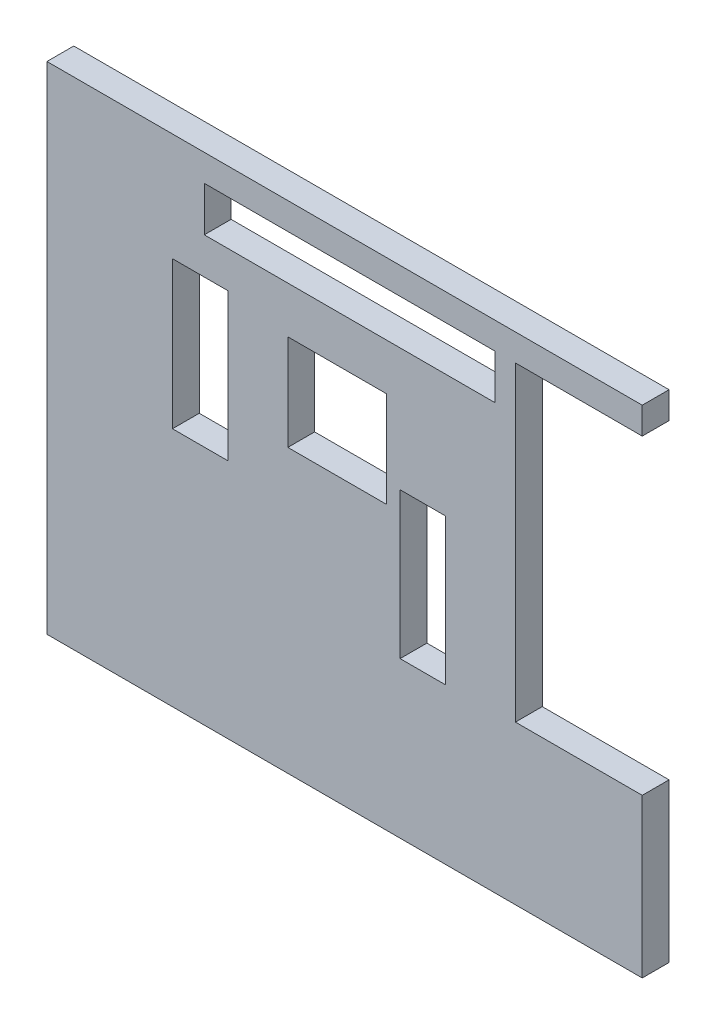
ISO-10303-21;
HEADER;
FILE_DESCRIPTION(('STEP AP214'),'2;1');
FILE_NAME('part.step','',(''),(''),'','','');
FILE_SCHEMA(('AUTOMOTIVE_DESIGN { 1 0 10303 214 1 1 1 1 }'));
ENDSEC;
DATA;
#1=APPLICATION_CONTEXT('core data for automotive mechanical design processes');
#2=APPLICATION_PROTOCOL_DEFINITION('international standard','automotive_design',2000,#1);
#3=PRODUCT_CONTEXT('',#1,'mechanical');
#4=PRODUCT('Part','Part','',(#3));
#5=PRODUCT_RELATED_PRODUCT_CATEGORY('part','',(#4));
#6=PRODUCT_DEFINITION_FORMATION('','',#4);
#7=PRODUCT_DEFINITION_CONTEXT('part definition',#1,'design');
#8=PRODUCT_DEFINITION('design','',#6,#7);
#9=PRODUCT_DEFINITION_SHAPE('','',#8);
#10=(LENGTH_UNIT() NAMED_UNIT(*) SI_UNIT(.MILLI.,.METRE.));
#11=(NAMED_UNIT(*) PLANE_ANGLE_UNIT() SI_UNIT($,.RADIAN.));
#12=(NAMED_UNIT(*) SI_UNIT($,.STERADIAN.) SOLID_ANGLE_UNIT());
#13=UNCERTAINTY_MEASURE_WITH_UNIT(LENGTH_MEASURE(1.E-05),#10,'distance_accuracy_value','');
#14=(GEOMETRIC_REPRESENTATION_CONTEXT(3) GLOBAL_UNCERTAINTY_ASSIGNED_CONTEXT((#13)) GLOBAL_UNIT_ASSIGNED_CONTEXT((#10,
#11,#12)) REPRESENTATION_CONTEXT('',''));
#15=CARTESIAN_POINT('',(0.,0.,0.));
#16=DIRECTION('',(0.,0.,1.));
#17=DIRECTION('',(1.,0.,0.));
#18=AXIS2_PLACEMENT_3D('',#15,#16,#17);
#19=CARTESIAN_POINT('',(0.,0.,5.));
#20=DIRECTION('',(0.,0.,1.));
#21=DIRECTION('',(1.,0.,0.));
#22=AXIS2_PLACEMENT_3D('',#19,#20,#21);
#23=PLANE('',#22);
#24=DIRECTION('',(-1.,0.,0.));
#25=VECTOR('',#24,1.);
#26=CARTESIAN_POINT('',(111.553582562333,91.831917191368,5.));
#27=LINE('',#26,#25);
#28=CARTESIAN_POINT('',(111.553582562333,91.831917191368,5.));
#29=VERTEX_POINT('',#28);
#30=CARTESIAN_POINT('',(0.553582562333453,91.831917191368,5.));
#31=VERTEX_POINT('',#30);
#32=EDGE_CURVE('E405',#29,#31,#27,.T.);
#33=ORIENTED_EDGE('',*,*,#32,.T.);
#34=DIRECTION('',(0.,-1.,0.));
#35=VECTOR('',#34,1.);
#36=CARTESIAN_POINT('',(0.553582562333453,91.831917191368,5.));
#37=LINE('',#36,#35);
#38=CARTESIAN_POINT('',(0.553582562333453,-0.668082808632039,5.));
#39=VERTEX_POINT('',#38);
#40=EDGE_CURVE('E409',#31,#39,#37,.T.);
#41=ORIENTED_EDGE('',*,*,#40,.T.);
#42=DIRECTION('',(-1.,0.,0.));
#43=VECTOR('',#42,1.);
#44=CARTESIAN_POINT('',(111.553582562334,-0.668082808632039,5.));
#45=LINE('',#44,#43);
#46=CARTESIAN_POINT('',(111.553582562334,-0.668082808632039,5.));
#47=VERTEX_POINT('',#46);
#48=EDGE_CURVE('E231',#47,#39,#45,.T.);
#49=ORIENTED_EDGE('',*,*,#48,.F.);
#50=DIRECTION('',(0.,1.,0.));
#51=VECTOR('',#50,1.);
#52=CARTESIAN_POINT('',(111.553582562334,5.33191719136796,5.));
#53=LINE('',#52,#51);
#54=CARTESIAN_POINT('',(111.553582562334,28.831917191368,5.));
#55=VERTEX_POINT('',#54);
#56=EDGE_CURVE('E413',#47,#55,#53,.T.);
#57=ORIENTED_EDGE('',*,*,#56,.T.);
#58=DIRECTION('',(-1.,0.,0.));
#59=VECTOR('',#58,1.);
#60=CARTESIAN_POINT('',(87.9094563292489,28.831917191368,5.));
#61=LINE('',#60,#59);
#62=CARTESIAN_POINT('',(87.9094563292489,28.831917191368,5.));
#63=VERTEX_POINT('',#62);
#64=EDGE_CURVE('E416',#55,#63,#61,.T.);
#65=ORIENTED_EDGE('',*,*,#64,.T.);
#66=DIRECTION('',(0.,1.,0.));
#67=VECTOR('',#66,1.);
#68=CARTESIAN_POINT('',(87.9094563292489,86.831917191368,5.));
#69=LINE('',#68,#67);
#70=CARTESIAN_POINT('',(87.9094563292489,86.831917191368,5.));
#71=VERTEX_POINT('',#70);
#72=EDGE_CURVE('E419',#63,#71,#69,.T.);
#73=ORIENTED_EDGE('',*,*,#72,.T.);
#74=DIRECTION('',(1.,0.,0.));
#75=VECTOR('',#74,1.);
#76=CARTESIAN_POINT('',(87.9094563292489,86.831917191368,5.));
#77=LINE('',#76,#75);
#78=CARTESIAN_POINT('',(111.553582562334,86.831917191368,5.));
#79=VERTEX_POINT('',#78);
#80=EDGE_CURVE('E422',#71,#79,#77,.T.);
#81=ORIENTED_EDGE('',*,*,#80,.T.);
#82=DIRECTION('',(0.,1.,0.));
#83=VECTOR('',#82,1.);
#84=CARTESIAN_POINT('',(111.553582562334,86.831917191368,5.));
#85=LINE('',#84,#83);
#86=EDGE_CURVE('E425',#79,#29,#85,.T.);
#87=ORIENTED_EDGE('',*,*,#86,.T.);
#88=EDGE_LOOP('',(#33,#41,#49,#57,#65,#73,#81,#87));
#89=FACE_BOUND('',#88,.T.);
#90=DIRECTION('',(1.,0.,0.));
#91=VECTOR('',#90,1.);
#92=CARTESIAN_POINT('',(29.8895659596349,78.5077999769822,5.));
#93=LINE('',#92,#91);
#94=CARTESIAN_POINT('',(29.8895659596349,78.5077999769822,5.));
#95=VERTEX_POINT('',#94);
#96=CARTESIAN_POINT('',(84.0931199139453,78.5077999769822,5.));
#97=VERTEX_POINT('',#96);
#98=EDGE_CURVE('E366',#95,#97,#93,.T.);
#99=ORIENTED_EDGE('',*,*,#98,.F.);
#100=DIRECTION('',(0.,-1.,0.));
#101=VECTOR('',#100,1.);
#102=CARTESIAN_POINT('',(29.8895659596349,86.831917191368,5.));
#103=LINE('',#102,#101);
#104=CARTESIAN_POINT('',(29.8895659596349,86.831917191368,5.));
#105=VERTEX_POINT('',#104);
#106=EDGE_CURVE('E363',#105,#95,#103,.T.);
#107=ORIENTED_EDGE('',*,*,#106,.F.);
#108=DIRECTION('',(-1.,0.,0.));
#109=VECTOR('',#108,1.);
#110=CARTESIAN_POINT('',(29.8895659596349,86.831917191368,5.));
#111=LINE('',#110,#109);
#112=CARTESIAN_POINT('',(84.0931199139453,86.831917191368,5.));
#113=VERTEX_POINT('',#112);
#114=EDGE_CURVE('E374',#113,#105,#111,.T.);
#115=ORIENTED_EDGE('',*,*,#114,.F.);
#116=DIRECTION('',(0.,1.,0.));
#117=VECTOR('',#116,1.);
#118=CARTESIAN_POINT('',(84.0931199139453,86.831917191368,5.));
#119=LINE('',#118,#117);
#120=EDGE_CURVE('E370',#97,#113,#119,.T.);
#121=ORIENTED_EDGE('',*,*,#120,.F.);
#122=EDGE_LOOP('',(#99,#107,#115,#121));
#123=FACE_BOUND('',#122,.T.);
#124=DIRECTION('',(1.,0.,0.));
#125=VECTOR('',#124,1.);
#126=CARTESIAN_POINT('',(23.9606206307256,44.2276050995337,5.));
#127=LINE('',#126,#125);
#128=CARTESIAN_POINT('',(23.9606206307256,44.2276050995337,5.));
#129=VERTEX_POINT('',#128);
#130=CARTESIAN_POINT('',(34.3307020953509,44.2276050995337,5.));
#131=VERTEX_POINT('',#130);
#132=EDGE_CURVE('E323',#129,#131,#127,.T.);
#133=ORIENTED_EDGE('',*,*,#132,.F.);
#134=DIRECTION('',(0.,-1.,0.));
#135=VECTOR('',#134,1.);
#136=CARTESIAN_POINT('',(23.9606206307256,71.6891171262523,5.));
#137=LINE('',#136,#135);
#138=CARTESIAN_POINT('',(23.9606206307256,71.6891171262523,5.));
#139=VERTEX_POINT('',#138);
#140=EDGE_CURVE('E320',#139,#129,#137,.T.);
#141=ORIENTED_EDGE('',*,*,#140,.F.);
#142=DIRECTION('',(-1.,0.,0.));
#143=VECTOR('',#142,1.);
#144=CARTESIAN_POINT('',(23.9606206307256,71.6891171262523,5.));
#145=LINE('',#144,#143);
#146=CARTESIAN_POINT('',(34.3307020953509,71.6891171262523,5.));
#147=VERTEX_POINT('',#146);
#148=EDGE_CURVE('E331',#147,#139,#145,.T.);
#149=ORIENTED_EDGE('',*,*,#148,.F.);
#150=DIRECTION('',(0.,1.,0.));
#151=VECTOR('',#150,1.);
#152=CARTESIAN_POINT('',(34.3307020953509,71.6891171262523,5.));
#153=LINE('',#152,#151);
#154=EDGE_CURVE('E327',#131,#147,#153,.T.);
#155=ORIENTED_EDGE('',*,*,#154,.F.);
#156=EDGE_LOOP('',(#133,#141,#149,#155));
#157=FACE_BOUND('',#156,.T.);
#158=DIRECTION('',(1.,0.,0.));
#159=VECTOR('',#158,1.);
#160=CARTESIAN_POINT('',(66.4011392174332,28.331917191368,5.));
#161=LINE('',#160,#159);
#162=CARTESIAN_POINT('',(66.4011392174332,28.331917191368,5.));
#163=VERTEX_POINT('',#162);
#164=CARTESIAN_POINT('',(74.8508352256465,28.331917191368,5.));
#165=VERTEX_POINT('',#164);
#166=EDGE_CURVE('E280',#163,#165,#161,.T.);
#167=ORIENTED_EDGE('',*,*,#166,.F.);
#168=DIRECTION('',(0.,-1.,0.));
#169=VECTOR('',#168,1.);
#170=CARTESIAN_POINT('',(66.4011392174332,55.6013906724237,5.));
#171=LINE('',#170,#169);
#172=CARTESIAN_POINT('',(66.4011392174332,55.6013906724237,5.));
#173=VERTEX_POINT('',#172);
#174=EDGE_CURVE('E277',#173,#163,#171,.T.);
#175=ORIENTED_EDGE('',*,*,#174,.F.);
#176=DIRECTION('',(-1.,0.,0.));
#177=VECTOR('',#176,1.);
#178=CARTESIAN_POINT('',(66.4011392174332,55.6013906724237,5.));
#179=LINE('',#178,#177);
#180=CARTESIAN_POINT('',(74.8508352256465,55.6013906724237,5.));
#181=VERTEX_POINT('',#180);
#182=EDGE_CURVE('E288',#181,#173,#179,.T.);
#183=ORIENTED_EDGE('',*,*,#182,.F.);
#184=DIRECTION('',(0.,1.,0.));
#185=VECTOR('',#184,1.);
#186=CARTESIAN_POINT('',(74.8508352256465,55.6013906724237,5.));
#187=LINE('',#186,#185);
#188=EDGE_CURVE('E284',#165,#181,#187,.T.);
#189=ORIENTED_EDGE('',*,*,#188,.F.);
#190=EDGE_LOOP('',(#167,#175,#183,#189));
#191=FACE_BOUND('',#190,.T.);
#192=DIRECTION('',(1.,0.,0.));
#193=VECTOR('',#192,1.);
#194=CARTESIAN_POINT('',(45.4689377425412,51.9723324467121,5.));
#195=LINE('',#194,#193);
#196=CARTESIAN_POINT('',(45.4689377425412,51.9723324467121,5.));
#197=VERTEX_POINT('',#196);
#198=CARTESIAN_POINT('',(63.9046381240975,51.9723324467121,5.));
#199=VERTEX_POINT('',#198);
#200=EDGE_CURVE('E242',#197,#199,#195,.T.);
#201=ORIENTED_EDGE('',*,*,#200,.F.);
#202=DIRECTION('',(0.,-1.,0.));
#203=VECTOR('',#202,1.);
#204=CARTESIAN_POINT('',(45.4689377425412,69.831917191368,5.));
#205=LINE('',#204,#203);
#206=CARTESIAN_POINT('',(45.4689377425412,69.831917191368,5.));
#207=VERTEX_POINT('',#206);
#208=EDGE_CURVE('E239',#207,#197,#205,.T.);
#209=ORIENTED_EDGE('',*,*,#208,.F.);
#210=DIRECTION('',(-1.,0.,0.));
#211=VECTOR('',#210,1.);
#212=CARTESIAN_POINT('',(45.4689377425412,69.831917191368,5.));
#213=LINE('',#212,#211);
#214=CARTESIAN_POINT('',(63.9046381240975,69.831917191368,5.));
#215=VERTEX_POINT('',#214);
#216=EDGE_CURVE('E249',#215,#207,#213,.T.);
#217=ORIENTED_EDGE('',*,*,#216,.F.);
#218=DIRECTION('',(0.,1.,0.));
#219=VECTOR('',#218,1.);
#220=CARTESIAN_POINT('',(63.9046381240975,69.831917191368,5.));
#221=LINE('',#220,#219);
#222=EDGE_CURVE('E246',#199,#215,#221,.T.);
#223=ORIENTED_EDGE('',*,*,#222,.F.);
#224=EDGE_LOOP('',(#201,#209,#217,#223));
#225=FACE_BOUND('',#224,.T.);
#226=ADVANCED_FACE('F41',(#89,#123,#157,#191,#225),#23,.T.);
#227=CARTESIAN_POINT('',(0.,0.,0.));
#228=DIRECTION('',(0.,0.,1.));
#229=DIRECTION('',(1.,0.,0.));
#230=AXIS2_PLACEMENT_3D('',#227,#228,#229);
#231=PLANE('',#230);
#232=DIRECTION('',(0.,-1.,0.));
#233=VECTOR('',#232,1.);
#234=CARTESIAN_POINT('',(66.4011392174332,55.6013906724237,0.));
#235=LINE('',#234,#233);
#236=CARTESIAN_POINT('',(66.4011392174332,55.6013906724237,0.));
#237=VERTEX_POINT('',#236);
#238=CARTESIAN_POINT('',(66.4011392174332,28.331917191368,0.));
#239=VERTEX_POINT('',#238);
#240=EDGE_CURVE('E276',#237,#239,#235,.T.);
#241=ORIENTED_EDGE('',*,*,#240,.T.);
#242=DIRECTION('',(1.,0.,0.));
#243=VECTOR('',#242,1.);
#244=CARTESIAN_POINT('',(66.4011392174332,28.331917191368,0.));
#245=LINE('',#244,#243);
#246=CARTESIAN_POINT('',(74.8508352256465,28.331917191368,0.));
#247=VERTEX_POINT('',#246);
#248=EDGE_CURVE('E295',#239,#247,#245,.T.);
#249=ORIENTED_EDGE('',*,*,#248,.T.);
#250=DIRECTION('',(0.,1.,0.));
#251=VECTOR('',#250,1.);
#252=CARTESIAN_POINT('',(74.8508352256465,55.6013906724237,0.));
#253=LINE('',#252,#251);
#254=CARTESIAN_POINT('',(74.8508352256465,55.6013906724237,0.));
#255=VERTEX_POINT('',#254);
#256=EDGE_CURVE('E299',#247,#255,#253,.T.);
#257=ORIENTED_EDGE('',*,*,#256,.T.);
#258=DIRECTION('',(-1.,0.,0.));
#259=VECTOR('',#258,1.);
#260=CARTESIAN_POINT('',(66.4011392174332,55.6013906724237,0.));
#261=LINE('',#260,#259);
#262=EDGE_CURVE('E281',#255,#237,#261,.T.);
#263=ORIENTED_EDGE('',*,*,#262,.T.);
#264=EDGE_LOOP('',(#241,#249,#257,#263));
#265=FACE_BOUND('',#264,.T.);
#266=DIRECTION('',(0.,-1.,0.));
#267=VECTOR('',#266,1.);
#268=CARTESIAN_POINT('',(29.8895659596349,86.831917191368,0.));
#269=LINE('',#268,#267);
#270=CARTESIAN_POINT('',(29.8895659596349,86.831917191368,0.));
#271=VERTEX_POINT('',#270);
#272=CARTESIAN_POINT('',(29.8895659596349,78.5077999769822,0.));
#273=VERTEX_POINT('',#272);
#274=EDGE_CURVE('E362',#271,#273,#269,.T.);
#275=ORIENTED_EDGE('',*,*,#274,.T.);
#276=DIRECTION('',(1.,0.,0.));
#277=VECTOR('',#276,1.);
#278=CARTESIAN_POINT('',(29.8895659596349,78.5077999769822,0.));
#279=LINE('',#278,#277);
#280=CARTESIAN_POINT('',(84.0931199139453,78.5077999769822,0.));
#281=VERTEX_POINT('',#280);
#282=EDGE_CURVE('E381',#273,#281,#279,.T.);
#283=ORIENTED_EDGE('',*,*,#282,.T.);
#284=DIRECTION('',(0.,1.,0.));
#285=VECTOR('',#284,1.);
#286=CARTESIAN_POINT('',(84.0931199139453,86.831917191368,0.));
#287=LINE('',#286,#285);
#288=CARTESIAN_POINT('',(84.0931199139453,86.831917191368,0.));
#289=VERTEX_POINT('',#288);
#290=EDGE_CURVE('E385',#281,#289,#287,.T.);
#291=ORIENTED_EDGE('',*,*,#290,.T.);
#292=DIRECTION('',(-1.,0.,0.));
#293=VECTOR('',#292,1.);
#294=CARTESIAN_POINT('',(29.8895659596349,86.831917191368,0.));
#295=LINE('',#294,#293);
#296=EDGE_CURVE('E367',#289,#271,#295,.T.);
#297=ORIENTED_EDGE('',*,*,#296,.T.);
#298=EDGE_LOOP('',(#275,#283,#291,#297));
#299=FACE_BOUND('',#298,.T.);
#300=DIRECTION('',(-1.,0.,0.));
#301=VECTOR('',#300,1.);
#302=CARTESIAN_POINT('',(111.553582562333,91.831917191368,0.));
#303=LINE('',#302,#301);
#304=CARTESIAN_POINT('',(111.553582562333,91.831917191368,0.));
#305=VERTEX_POINT('',#304);
#306=CARTESIAN_POINT('',(0.553582562333453,91.831917191368,0.));
#307=VERTEX_POINT('',#306);
#308=EDGE_CURVE('E215',#305,#307,#303,.T.);
#309=ORIENTED_EDGE('',*,*,#308,.F.);
#310=DIRECTION('',(0.,1.,0.));
#311=VECTOR('',#310,1.);
#312=CARTESIAN_POINT('',(111.553582562334,86.831917191368,0.));
#313=LINE('',#312,#311);
#314=CARTESIAN_POINT('',(111.553582562334,86.831917191368,0.));
#315=VERTEX_POINT('',#314);
#316=EDGE_CURVE('E410',#315,#305,#313,.T.);
#317=ORIENTED_EDGE('',*,*,#316,.F.);
#318=DIRECTION('',(1.,0.,0.));
#319=VECTOR('',#318,1.);
#320=CARTESIAN_POINT('',(87.9094563292489,86.831917191368,0.));
#321=LINE('',#320,#319);
#322=CARTESIAN_POINT('',(87.9094563292489,86.831917191368,0.));
#323=VERTEX_POINT('',#322);
#324=EDGE_CURVE('E439',#323,#315,#321,.T.);
#325=ORIENTED_EDGE('',*,*,#324,.F.);
#326=DIRECTION('',(0.,1.,0.));
#327=VECTOR('',#326,1.);
#328=CARTESIAN_POINT('',(87.9094563292489,86.831917191368,0.));
#329=LINE('',#328,#327);
#330=CARTESIAN_POINT('',(87.9094563292489,28.831917191368,0.));
#331=VERTEX_POINT('',#330);
#332=EDGE_CURVE('E436',#331,#323,#329,.T.);
#333=ORIENTED_EDGE('',*,*,#332,.F.);
#334=DIRECTION('',(-1.,0.,0.));
#335=VECTOR('',#334,1.);
#336=CARTESIAN_POINT('',(87.9094563292489,28.831917191368,0.));
#337=LINE('',#336,#335);
#338=CARTESIAN_POINT('',(111.553582562334,28.831917191368,0.));
#339=VERTEX_POINT('',#338);
#340=EDGE_CURVE('E433',#339,#331,#337,.T.);
#341=ORIENTED_EDGE('',*,*,#340,.F.);
#342=DIRECTION('',(0.,1.,0.));
#343=VECTOR('',#342,1.);
#344=CARTESIAN_POINT('',(111.553582562334,5.33191719136796,0.));
#345=LINE('',#344,#343);
#346=CARTESIAN_POINT('',(111.553582562334,-0.668082808632039,0.));
#347=VERTEX_POINT('',#346);
#348=EDGE_CURVE('E214',#347,#339,#345,.T.);
#349=ORIENTED_EDGE('',*,*,#348,.F.);
#350=DIRECTION('',(1.,0.,0.));
#351=VECTOR('',#350,1.);
#352=CARTESIAN_POINT('',(0.553582562333453,-0.668082808632039,0.));
#353=LINE('',#352,#351);
#354=CARTESIAN_POINT('',(0.553582562333453,-0.668082808632039,0.));
#355=VERTEX_POINT('',#354);
#356=EDGE_CURVE('E218',#355,#347,#353,.T.);
#357=ORIENTED_EDGE('',*,*,#356,.F.);
#358=DIRECTION('',(0.,-1.,0.));
#359=VECTOR('',#358,1.);
#360=CARTESIAN_POINT('',(0.553582562333453,91.831917191368,0.));
#361=LINE('',#360,#359);
#362=EDGE_CURVE('E204',#307,#355,#361,.T.);
#363=ORIENTED_EDGE('',*,*,#362,.F.);
#364=EDGE_LOOP('',(#309,#317,#325,#333,#341,#349,#357,#363));
#365=FACE_BOUND('',#364,.T.);
#366=DIRECTION('',(0.,-1.,0.));
#367=VECTOR('',#366,1.);
#368=CARTESIAN_POINT('',(23.9606206307256,71.6891171262523,0.));
#369=LINE('',#368,#367);
#370=CARTESIAN_POINT('',(23.9606206307256,71.6891171262523,0.));
#371=VERTEX_POINT('',#370);
#372=CARTESIAN_POINT('',(23.9606206307256,44.2276050995337,0.));
#373=VERTEX_POINT('',#372);
#374=EDGE_CURVE('E319',#371,#373,#369,.T.);
#375=ORIENTED_EDGE('',*,*,#374,.T.);
#376=DIRECTION('',(1.,0.,0.));
#377=VECTOR('',#376,1.);
#378=CARTESIAN_POINT('',(23.9606206307256,44.2276050995337,0.));
#379=LINE('',#378,#377);
#380=CARTESIAN_POINT('',(34.3307020953509,44.2276050995337,0.));
#381=VERTEX_POINT('',#380);
#382=EDGE_CURVE('E338',#373,#381,#379,.T.);
#383=ORIENTED_EDGE('',*,*,#382,.T.);
#384=DIRECTION('',(0.,1.,0.));
#385=VECTOR('',#384,1.);
#386=CARTESIAN_POINT('',(34.3307020953509,71.6891171262523,0.));
#387=LINE('',#386,#385);
#388=CARTESIAN_POINT('',(34.3307020953509,71.6891171262523,0.));
#389=VERTEX_POINT('',#388);
#390=EDGE_CURVE('E342',#381,#389,#387,.T.);
#391=ORIENTED_EDGE('',*,*,#390,.T.);
#392=DIRECTION('',(-1.,0.,0.));
#393=VECTOR('',#392,1.);
#394=CARTESIAN_POINT('',(23.9606206307256,71.6891171262523,0.));
#395=LINE('',#394,#393);
#396=EDGE_CURVE('E324',#389,#371,#395,.T.);
#397=ORIENTED_EDGE('',*,*,#396,.T.);
#398=EDGE_LOOP('',(#375,#383,#391,#397));
#399=FACE_BOUND('',#398,.T.);
#400=DIRECTION('',(0.,-1.,0.));
#401=VECTOR('',#400,1.);
#402=CARTESIAN_POINT('',(45.4689377425412,69.831917191368,0.));
#403=LINE('',#402,#401);
#404=CARTESIAN_POINT('',(45.4689377425412,69.831917191368,0.));
#405=VERTEX_POINT('',#404);
#406=CARTESIAN_POINT('',(45.4689377425412,51.9723324467121,0.));
#407=VERTEX_POINT('',#406);
#408=EDGE_CURVE('E65',#405,#407,#403,.T.);
#409=ORIENTED_EDGE('',*,*,#408,.T.);
#410=DIRECTION('',(1.,0.,0.));
#411=VECTOR('',#410,1.);
#412=CARTESIAN_POINT('',(45.4689377425412,51.9723324467121,0.));
#413=LINE('',#412,#411);
#414=CARTESIAN_POINT('',(63.9046381240975,51.9723324467121,0.));
#415=VERTEX_POINT('',#414);
#416=EDGE_CURVE('E255',#407,#415,#413,.T.);
#417=ORIENTED_EDGE('',*,*,#416,.T.);
#418=DIRECTION('',(0.,1.,0.));
#419=VECTOR('',#418,1.);
#420=CARTESIAN_POINT('',(63.9046381240975,69.831917191368,0.));
#421=LINE('',#420,#419);
#422=CARTESIAN_POINT('',(63.9046381240975,69.831917191368,0.));
#423=VERTEX_POINT('',#422);
#424=EDGE_CURVE('E259',#415,#423,#421,.T.);
#425=ORIENTED_EDGE('',*,*,#424,.T.);
#426=DIRECTION('',(-1.,0.,0.));
#427=VECTOR('',#426,1.);
#428=CARTESIAN_POINT('',(45.4689377425412,69.831917191368,0.));
#429=LINE('',#428,#427);
#430=EDGE_CURVE('E243',#423,#405,#429,.T.);
#431=ORIENTED_EDGE('',*,*,#430,.T.);
#432=EDGE_LOOP('',(#409,#417,#425,#431));
#433=FACE_BOUND('',#432,.T.);
#434=ADVANCED_FACE('F219',(#265,#299,#365,#399,#433),#231,.F.);
#435=CARTESIAN_POINT('',(111.553582562333,91.831917191368,5.));
#436=DIRECTION('',(0.,-1.,0.));
#437=DIRECTION('',(1.,0.,0.));
#438=AXIS2_PLACEMENT_3D('',#435,#436,#437);
#439=PLANE('',#438);
#440=ORIENTED_EDGE('',*,*,#308,.T.);
#441=DIRECTION('',(0.,0.,-1.));
#442=VECTOR('',#441,1.);
#443=CARTESIAN_POINT('',(0.553582562333453,91.831917191368,5.));
#444=LINE('',#443,#442);
#445=EDGE_CURVE('E11',#31,#307,#444,.T.);
#446=ORIENTED_EDGE('',*,*,#445,.F.);
#447=ORIENTED_EDGE('',*,*,#32,.F.);
#448=DIRECTION('',(0.,0.,-1.));
#449=VECTOR('',#448,1.);
#450=CARTESIAN_POINT('',(111.553582562333,91.831917191368,5.));
#451=LINE('',#450,#449);
#452=EDGE_CURVE('E428',#29,#305,#451,.T.);
#453=ORIENTED_EDGE('',*,*,#452,.T.);
#454=EDGE_LOOP('',(#440,#446,#447,#453));
#455=FACE_BOUND('',#454,.T.);
#456=ADVANCED_FACE('F43',(#455),#439,.F.);
#457=CARTESIAN_POINT('',(0.553582562333453,91.831917191368,5.));
#458=DIRECTION('',(1.,0.,0.));
#459=DIRECTION('',(0.,0.,-1.));
#460=AXIS2_PLACEMENT_3D('',#457,#458,#459);
#461=PLANE('',#460);
#462=ORIENTED_EDGE('',*,*,#362,.T.);
#463=DIRECTION('',(0.,0.,-1.));
#464=VECTOR('',#463,1.);
#465=CARTESIAN_POINT('',(0.553582562333453,-0.668082808632039,5.));
#466=LINE('',#465,#464);
#467=EDGE_CURVE('E208',#39,#355,#466,.T.);
#468=ORIENTED_EDGE('',*,*,#467,.F.);
#469=ORIENTED_EDGE('',*,*,#40,.F.);
#470=ORIENTED_EDGE('',*,*,#445,.T.);
#471=EDGE_LOOP('',(#462,#468,#469,#470));
#472=FACE_BOUND('',#471,.T.);
#473=ADVANCED_FACE('F206',(#472),#461,.F.);
#474=CARTESIAN_POINT('',(111.553582562334,5.33191719136796,5.));
#475=DIRECTION('',(-1.,0.,0.));
#476=DIRECTION('',(0.,0.,1.));
#477=AXIS2_PLACEMENT_3D('',#474,#475,#476);
#478=PLANE('',#477);
#479=ORIENTED_EDGE('',*,*,#348,.T.);
#480=DIRECTION('',(0.,0.,-1.));
#481=VECTOR('',#480,1.);
#482=CARTESIAN_POINT('',(111.553582562334,28.831917191368,5.));
#483=LINE('',#482,#481);
#484=EDGE_CURVE('E50',#55,#339,#483,.T.);
#485=ORIENTED_EDGE('',*,*,#484,.F.);
#486=ORIENTED_EDGE('',*,*,#56,.F.);
#487=DIRECTION('',(0.,0.,1.));
#488=VECTOR('',#487,1.);
#489=CARTESIAN_POINT('',(111.553582562334,-0.668082808632039,0.));
#490=LINE('',#489,#488);
#491=EDGE_CURVE('E226',#347,#47,#490,.T.);
#492=ORIENTED_EDGE('',*,*,#491,.F.);
#493=EDGE_LOOP('',(#479,#485,#486,#492));
#494=FACE_BOUND('',#493,.T.);
#495=ADVANCED_FACE('F481',(#494),#478,.F.);
#496=CARTESIAN_POINT('',(87.9094563292489,28.831917191368,5.));
#497=DIRECTION('',(0.,-1.,0.));
#498=DIRECTION('',(1.,0.,0.));
#499=AXIS2_PLACEMENT_3D('',#496,#497,#498);
#500=PLANE('',#499);
#501=ORIENTED_EDGE('',*,*,#340,.T.);
#502=DIRECTION('',(0.,0.,-1.));
#503=VECTOR('',#502,1.);
#504=CARTESIAN_POINT('',(87.9094563292489,28.831917191368,5.));
#505=LINE('',#504,#503);
#506=EDGE_CURVE('E455',#63,#331,#505,.T.);
#507=ORIENTED_EDGE('',*,*,#506,.F.);
#508=ORIENTED_EDGE('',*,*,#64,.F.);
#509=ORIENTED_EDGE('',*,*,#484,.T.);
#510=EDGE_LOOP('',(#501,#507,#508,#509));
#511=FACE_BOUND('',#510,.T.);
#512=ADVANCED_FACE('F463',(#511),#500,.F.);
#513=CARTESIAN_POINT('',(87.9094563292489,86.831917191368,5.));
#514=DIRECTION('',(-1.,0.,0.));
#515=DIRECTION('',(0.,0.,1.));
#516=AXIS2_PLACEMENT_3D('',#513,#514,#515);
#517=PLANE('',#516);
#518=ORIENTED_EDGE('',*,*,#332,.T.);
#519=DIRECTION('',(0.,0.,-1.));
#520=VECTOR('',#519,1.);
#521=CARTESIAN_POINT('',(87.9094563292489,86.831917191368,5.));
#522=LINE('',#521,#520);
#523=EDGE_CURVE('E451',#71,#323,#522,.T.);
#524=ORIENTED_EDGE('',*,*,#523,.F.);
#525=ORIENTED_EDGE('',*,*,#72,.F.);
#526=ORIENTED_EDGE('',*,*,#506,.T.);
#527=EDGE_LOOP('',(#518,#524,#525,#526));
#528=FACE_BOUND('',#527,.T.);
#529=ADVANCED_FACE('F471',(#528),#517,.F.);
#530=CARTESIAN_POINT('',(87.9094563292489,86.831917191368,5.));
#531=DIRECTION('',(0.,1.,0.));
#532=DIRECTION('',(0.,0.,1.));
#533=AXIS2_PLACEMENT_3D('',#530,#531,#532);
#534=PLANE('',#533);
#535=ORIENTED_EDGE('',*,*,#324,.T.);
#536=DIRECTION('',(0.,0.,-1.));
#537=VECTOR('',#536,1.);
#538=CARTESIAN_POINT('',(111.553582562334,86.831917191368,5.));
#539=LINE('',#538,#537);
#540=EDGE_CURVE('E447',#79,#315,#539,.T.);
#541=ORIENTED_EDGE('',*,*,#540,.F.);
#542=ORIENTED_EDGE('',*,*,#80,.F.);
#543=ORIENTED_EDGE('',*,*,#523,.T.);
#544=EDGE_LOOP('',(#535,#541,#542,#543));
#545=FACE_BOUND('',#544,.T.);
#546=ADVANCED_FACE('F475',(#545),#534,.F.);
#547=CARTESIAN_POINT('',(111.553582562334,86.831917191368,5.));
#548=DIRECTION('',(-1.,0.,0.));
#549=DIRECTION('',(0.,-1.,0.));
#550=AXIS2_PLACEMENT_3D('',#547,#548,#549);
#551=PLANE('',#550);
#552=ORIENTED_EDGE('',*,*,#316,.T.);
#553=ORIENTED_EDGE('',*,*,#452,.F.);
#554=ORIENTED_EDGE('',*,*,#86,.F.);
#555=ORIENTED_EDGE('',*,*,#540,.T.);
#556=EDGE_LOOP('',(#552,#553,#554,#555));
#557=FACE_BOUND('',#556,.T.);
#558=ADVANCED_FACE('F502',(#557),#551,.F.);
#559=CARTESIAN_POINT('',(29.8895659596349,86.831917191368,5.));
#560=DIRECTION('',(1.,0.,0.));
#561=DIRECTION('',(0.,0.,-1.));
#562=AXIS2_PLACEMENT_3D('',#559,#560,#561);
#563=PLANE('',#562);
#564=ORIENTED_EDGE('',*,*,#274,.F.);
#565=DIRECTION('',(0.,0.,-1.));
#566=VECTOR('',#565,1.);
#567=CARTESIAN_POINT('',(29.8895659596349,86.831917191368,5.));
#568=LINE('',#567,#566);
#569=EDGE_CURVE('E377',#105,#271,#568,.T.);
#570=ORIENTED_EDGE('',*,*,#569,.F.);
#571=ORIENTED_EDGE('',*,*,#106,.T.);
#572=DIRECTION('',(0.,0.,-1.));
#573=VECTOR('',#572,1.);
#574=CARTESIAN_POINT('',(29.8895659596349,78.5077999769822,5.));
#575=LINE('',#574,#573);
#576=EDGE_CURVE('E401',#95,#273,#575,.T.);
#577=ORIENTED_EDGE('',*,*,#576,.T.);
#578=EDGE_LOOP('',(#564,#570,#571,#577));
#579=FACE_BOUND('',#578,.T.);
#580=ADVANCED_FACE('F499',(#579),#563,.T.);
#581=CARTESIAN_POINT('',(29.8895659596349,78.5077999769822,5.));
#582=DIRECTION('',(0.,1.,0.));
#583=DIRECTION('',(-1.,0.,0.));
#584=AXIS2_PLACEMENT_3D('',#581,#582,#583);
#585=PLANE('',#584);
#586=ORIENTED_EDGE('',*,*,#282,.F.);
#587=ORIENTED_EDGE('',*,*,#576,.F.);
#588=ORIENTED_EDGE('',*,*,#98,.T.);
#589=DIRECTION('',(0.,0.,-1.));
#590=VECTOR('',#589,1.);
#591=CARTESIAN_POINT('',(84.0931199139453,78.5077999769822,5.));
#592=LINE('',#591,#590);
#593=EDGE_CURVE('E398',#97,#281,#592,.T.);
#594=ORIENTED_EDGE('',*,*,#593,.T.);
#595=EDGE_LOOP('',(#586,#587,#588,#594));
#596=FACE_BOUND('',#595,.T.);
#597=ADVANCED_FACE('F528',(#596),#585,.T.);
#598=CARTESIAN_POINT('',(84.0931199139453,86.831917191368,5.));
#599=DIRECTION('',(-1.,0.,0.));
#600=DIRECTION('',(0.,0.,1.));
#601=AXIS2_PLACEMENT_3D('',#598,#599,#600);
#602=PLANE('',#601);
#603=ORIENTED_EDGE('',*,*,#290,.F.);
#604=ORIENTED_EDGE('',*,*,#593,.F.);
#605=ORIENTED_EDGE('',*,*,#120,.T.);
#606=DIRECTION('',(0.,0.,-1.));
#607=VECTOR('',#606,1.);
#608=CARTESIAN_POINT('',(84.0931199139453,86.831917191368,5.));
#609=LINE('',#608,#607);
#610=EDGE_CURVE('E395',#113,#289,#609,.T.);
#611=ORIENTED_EDGE('',*,*,#610,.T.);
#612=EDGE_LOOP('',(#603,#604,#605,#611));
#613=FACE_BOUND('',#612,.T.);
#614=ADVANCED_FACE('F535',(#613),#602,.T.);
#615=CARTESIAN_POINT('',(29.8895659596349,86.831917191368,5.));
#616=DIRECTION('',(0.,-1.,0.));
#617=DIRECTION('',(1.,0.,0.));
#618=AXIS2_PLACEMENT_3D('',#615,#616,#617);
#619=PLANE('',#618);
#620=ORIENTED_EDGE('',*,*,#296,.F.);
#621=ORIENTED_EDGE('',*,*,#610,.F.);
#622=ORIENTED_EDGE('',*,*,#114,.T.);
#623=ORIENTED_EDGE('',*,*,#569,.T.);
#624=EDGE_LOOP('',(#620,#621,#622,#623));
#625=FACE_BOUND('',#624,.T.);
#626=ADVANCED_FACE('F542',(#625),#619,.T.);
#627=CARTESIAN_POINT('',(23.9606206307256,71.6891171262523,5.));
#628=DIRECTION('',(1.,0.,0.));
#629=DIRECTION('',(0.,1.,0.));
#630=AXIS2_PLACEMENT_3D('',#627,#628,#629);
#631=PLANE('',#630);
#632=ORIENTED_EDGE('',*,*,#374,.F.);
#633=DIRECTION('',(0.,0.,-1.));
#634=VECTOR('',#633,1.);
#635=CARTESIAN_POINT('',(23.9606206307256,71.6891171262523,5.));
#636=LINE('',#635,#634);
#637=EDGE_CURVE('E334',#139,#371,#636,.T.);
#638=ORIENTED_EDGE('',*,*,#637,.F.);
#639=ORIENTED_EDGE('',*,*,#140,.T.);
#640=DIRECTION('',(0.,0.,-1.));
#641=VECTOR('',#640,1.);
#642=CARTESIAN_POINT('',(23.9606206307256,44.2276050995337,5.));
#643=LINE('',#642,#641);
#644=EDGE_CURVE('E358',#129,#373,#643,.T.);
#645=ORIENTED_EDGE('',*,*,#644,.T.);
#646=EDGE_LOOP('',(#632,#638,#639,#645));
#647=FACE_BOUND('',#646,.T.);
#648=ADVANCED_FACE('F550',(#647),#631,.T.);
#649=CARTESIAN_POINT('',(23.9606206307256,44.2276050995337,5.));
#650=DIRECTION('',(0.,1.,0.));
#651=DIRECTION('',(0.,0.,1.));
#652=AXIS2_PLACEMENT_3D('',#649,#650,#651);
#653=PLANE('',#652);
#654=ORIENTED_EDGE('',*,*,#382,.F.);
#655=ORIENTED_EDGE('',*,*,#644,.F.);
#656=ORIENTED_EDGE('',*,*,#132,.T.);
#657=DIRECTION('',(0.,0.,-1.));
#658=VECTOR('',#657,1.);
#659=CARTESIAN_POINT('',(34.3307020953509,44.2276050995337,5.));
#660=LINE('',#659,#658);
#661=EDGE_CURVE('E355',#131,#381,#660,.T.);
#662=ORIENTED_EDGE('',*,*,#661,.T.);
#663=EDGE_LOOP('',(#654,#655,#656,#662));
#664=FACE_BOUND('',#663,.T.);
#665=ADVANCED_FACE('F558',(#664),#653,.T.);
#666=CARTESIAN_POINT('',(34.3307020953509,71.6891171262523,5.));
#667=DIRECTION('',(-1.,0.,0.));
#668=DIRECTION('',(0.,-1.,0.));
#669=AXIS2_PLACEMENT_3D('',#666,#667,#668);
#670=PLANE('',#669);
#671=ORIENTED_EDGE('',*,*,#390,.F.);
#672=ORIENTED_EDGE('',*,*,#661,.F.);
#673=ORIENTED_EDGE('',*,*,#154,.T.);
#674=DIRECTION('',(0.,0.,-1.));
#675=VECTOR('',#674,1.);
#676=CARTESIAN_POINT('',(34.3307020953509,71.6891171262523,5.));
#677=LINE('',#676,#675);
#678=EDGE_CURVE('E352',#147,#389,#677,.T.);
#679=ORIENTED_EDGE('',*,*,#678,.T.);
#680=EDGE_LOOP('',(#671,#672,#673,#679));
#681=FACE_BOUND('',#680,.T.);
#682=ADVANCED_FACE('F566',(#681),#670,.T.);
#683=CARTESIAN_POINT('',(23.9606206307256,71.6891171262523,5.));
#684=DIRECTION('',(0.,-1.,0.));
#685=DIRECTION('',(0.,0.,-1.));
#686=AXIS2_PLACEMENT_3D('',#683,#684,#685);
#687=PLANE('',#686);
#688=ORIENTED_EDGE('',*,*,#396,.F.);
#689=ORIENTED_EDGE('',*,*,#678,.F.);
#690=ORIENTED_EDGE('',*,*,#148,.T.);
#691=ORIENTED_EDGE('',*,*,#637,.T.);
#692=EDGE_LOOP('',(#688,#689,#690,#691));
#693=FACE_BOUND('',#692,.T.);
#694=ADVANCED_FACE('F574',(#693),#687,.T.);
#695=CARTESIAN_POINT('',(66.4011392174332,55.6013906724237,5.));
#696=DIRECTION('',(1.,0.,0.));
#697=DIRECTION('',(0.,0.,-1.));
#698=AXIS2_PLACEMENT_3D('',#695,#696,#697);
#699=PLANE('',#698);
#700=ORIENTED_EDGE('',*,*,#240,.F.);
#701=DIRECTION('',(0.,0.,-1.));
#702=VECTOR('',#701,1.);
#703=CARTESIAN_POINT('',(66.4011392174332,55.6013906724237,5.));
#704=LINE('',#703,#702);
#705=EDGE_CURVE('E291',#173,#237,#704,.T.);
#706=ORIENTED_EDGE('',*,*,#705,.F.);
#707=ORIENTED_EDGE('',*,*,#174,.T.);
#708=DIRECTION('',(0.,0.,-1.));
#709=VECTOR('',#708,1.);
#710=CARTESIAN_POINT('',(66.4011392174332,28.331917191368,5.));
#711=LINE('',#710,#709);
#712=EDGE_CURVE('E315',#163,#239,#711,.T.);
#713=ORIENTED_EDGE('',*,*,#712,.T.);
#714=EDGE_LOOP('',(#700,#706,#707,#713));
#715=FACE_BOUND('',#714,.T.);
#716=ADVANCED_FACE('F582',(#715),#699,.T.);
#717=CARTESIAN_POINT('',(66.4011392174332,28.331917191368,5.));
#718=DIRECTION('',(0.,1.,0.));
#719=DIRECTION('',(0.,0.,1.));
#720=AXIS2_PLACEMENT_3D('',#717,#718,#719);
#721=PLANE('',#720);
#722=ORIENTED_EDGE('',*,*,#248,.F.);
#723=ORIENTED_EDGE('',*,*,#712,.F.);
#724=ORIENTED_EDGE('',*,*,#166,.T.);
#725=DIRECTION('',(0.,0.,-1.));
#726=VECTOR('',#725,1.);
#727=CARTESIAN_POINT('',(74.8508352256465,28.331917191368,5.));
#728=LINE('',#727,#726);
#729=EDGE_CURVE('E312',#165,#247,#728,.T.);
#730=ORIENTED_EDGE('',*,*,#729,.T.);
#731=EDGE_LOOP('',(#722,#723,#724,#730));
#732=FACE_BOUND('',#731,.T.);
#733=ADVANCED_FACE('F590',(#732),#721,.T.);
#734=CARTESIAN_POINT('',(74.8508352256465,55.6013906724237,5.));
#735=DIRECTION('',(-1.,0.,0.));
#736=DIRECTION('',(0.,0.,1.));
#737=AXIS2_PLACEMENT_3D('',#734,#735,#736);
#738=PLANE('',#737);
#739=ORIENTED_EDGE('',*,*,#256,.F.);
#740=ORIENTED_EDGE('',*,*,#729,.F.);
#741=ORIENTED_EDGE('',*,*,#188,.T.);
#742=DIRECTION('',(0.,0.,-1.));
#743=VECTOR('',#742,1.);
#744=CARTESIAN_POINT('',(74.8508352256465,55.6013906724237,5.));
#745=LINE('',#744,#743);
#746=EDGE_CURVE('E309',#181,#255,#745,.T.);
#747=ORIENTED_EDGE('',*,*,#746,.T.);
#748=EDGE_LOOP('',(#739,#740,#741,#747));
#749=FACE_BOUND('',#748,.T.);
#750=ADVANCED_FACE('F598',(#749),#738,.T.);
#751=CARTESIAN_POINT('',(66.4011392174332,55.6013906724237,5.));
#752=DIRECTION('',(0.,-1.,0.));
#753=DIRECTION('',(0.,0.,-1.));
#754=AXIS2_PLACEMENT_3D('',#751,#752,#753);
#755=PLANE('',#754);
#756=ORIENTED_EDGE('',*,*,#262,.F.);
#757=ORIENTED_EDGE('',*,*,#746,.F.);
#758=ORIENTED_EDGE('',*,*,#182,.T.);
#759=ORIENTED_EDGE('',*,*,#705,.T.);
#760=EDGE_LOOP('',(#756,#757,#758,#759));
#761=FACE_BOUND('',#760,.T.);
#762=ADVANCED_FACE('F606',(#761),#755,.T.);
#763=CARTESIAN_POINT('',(45.4689377425412,69.831917191368,5.));
#764=DIRECTION('',(1.,0.,0.));
#765=DIRECTION('',(0.,1.,0.));
#766=AXIS2_PLACEMENT_3D('',#763,#764,#765);
#767=PLANE('',#766);
#768=ORIENTED_EDGE('',*,*,#408,.F.);
#769=DIRECTION('',(0.,0.,-1.));
#770=VECTOR('',#769,1.);
#771=CARTESIAN_POINT('',(45.4689377425412,69.831917191368,5.));
#772=LINE('',#771,#770);
#773=EDGE_CURVE('E252',#207,#405,#772,.T.);
#774=ORIENTED_EDGE('',*,*,#773,.F.);
#775=ORIENTED_EDGE('',*,*,#208,.T.);
#776=DIRECTION('',(0.,0.,-1.));
#777=VECTOR('',#776,1.);
#778=CARTESIAN_POINT('',(45.4689377425412,51.9723324467121,5.));
#779=LINE('',#778,#777);
#780=EDGE_CURVE('E273',#197,#407,#779,.T.);
#781=ORIENTED_EDGE('',*,*,#780,.T.);
#782=EDGE_LOOP('',(#768,#774,#775,#781));
#783=FACE_BOUND('',#782,.T.);
#784=ADVANCED_FACE('F614',(#783),#767,.T.);
#785=CARTESIAN_POINT('',(45.4689377425412,51.9723324467121,5.));
#786=DIRECTION('',(0.,1.,0.));
#787=DIRECTION('',(0.,0.,1.));
#788=AXIS2_PLACEMENT_3D('',#785,#786,#787);
#789=PLANE('',#788);
#790=ORIENTED_EDGE('',*,*,#416,.F.);
#791=ORIENTED_EDGE('',*,*,#780,.F.);
#792=ORIENTED_EDGE('',*,*,#200,.T.);
#793=DIRECTION('',(0.,0.,-1.));
#794=VECTOR('',#793,1.);
#795=CARTESIAN_POINT('',(63.9046381240975,51.9723324467121,5.));
#796=LINE('',#795,#794);
#797=EDGE_CURVE('E270',#199,#415,#796,.T.);
#798=ORIENTED_EDGE('',*,*,#797,.T.);
#799=EDGE_LOOP('',(#790,#791,#792,#798));
#800=FACE_BOUND('',#799,.T.);
#801=ADVANCED_FACE('F622',(#800),#789,.T.);
#802=CARTESIAN_POINT('',(63.9046381240975,69.831917191368,5.));
#803=DIRECTION('',(-1.,0.,0.));
#804=DIRECTION('',(0.,0.,1.));
#805=AXIS2_PLACEMENT_3D('',#802,#803,#804);
#806=PLANE('',#805);
#807=ORIENTED_EDGE('',*,*,#424,.F.);
#808=ORIENTED_EDGE('',*,*,#797,.F.);
#809=ORIENTED_EDGE('',*,*,#222,.T.);
#810=DIRECTION('',(0.,0.,-1.));
#811=VECTOR('',#810,1.);
#812=CARTESIAN_POINT('',(63.9046381240975,69.831917191368,5.));
#813=LINE('',#812,#811);
#814=EDGE_CURVE('E57',#215,#423,#813,.T.);
#815=ORIENTED_EDGE('',*,*,#814,.T.);
#816=EDGE_LOOP('',(#807,#808,#809,#815));
#817=FACE_BOUND('',#816,.T.);
#818=ADVANCED_FACE('F629',(#817),#806,.T.);
#819=CARTESIAN_POINT('',(45.4689377425412,69.831917191368,5.));
#820=DIRECTION('',(0.,-1.,0.));
#821=DIRECTION('',(0.,0.,-1.));
#822=AXIS2_PLACEMENT_3D('',#819,#820,#821);
#823=PLANE('',#822);
#824=ORIENTED_EDGE('',*,*,#430,.F.);
#825=ORIENTED_EDGE('',*,*,#814,.F.);
#826=ORIENTED_EDGE('',*,*,#216,.T.);
#827=ORIENTED_EDGE('',*,*,#773,.T.);
#828=EDGE_LOOP('',(#824,#825,#826,#827));
#829=FACE_BOUND('',#828,.T.);
#830=ADVANCED_FACE('F636',(#829),#823,.T.);
#831=CARTESIAN_POINT('',(0.,-0.668082808632039,0.));
#832=DIRECTION('',(0.,-1.,0.));
#833=DIRECTION('',(0.,0.,-1.));
#834=AXIS2_PLACEMENT_3D('',#831,#832,#833);
#835=PLANE('',#834);
#836=ORIENTED_EDGE('',*,*,#467,.T.);
#837=ORIENTED_EDGE('',*,*,#356,.T.);
#838=ORIENTED_EDGE('',*,*,#491,.T.);
#839=ORIENTED_EDGE('',*,*,#48,.T.);
#840=EDGE_LOOP('',(#836,#837,#838,#839));
#841=FACE_BOUND('',#840,.T.);
#842=ADVANCED_FACE('F229',(#841),#835,.T.);
#843=CLOSED_SHELL('',(#226,#434,#456,#473,#495,#512,#529,#546,#558,#580,#597,#614,#626,#648,
#665,#682,#694,#716,#733,#750,#762,#784,#801,#818,#830,#842));
#844=MANIFOLD_SOLID_BREP('B2',#843);
#845=ADVANCED_BREP_SHAPE_REPRESENTATION('',(#18,#844),#14);
#846=SHAPE_DEFINITION_REPRESENTATION(#9,#845);
ENDSEC;
END-ISO-10303-21;
